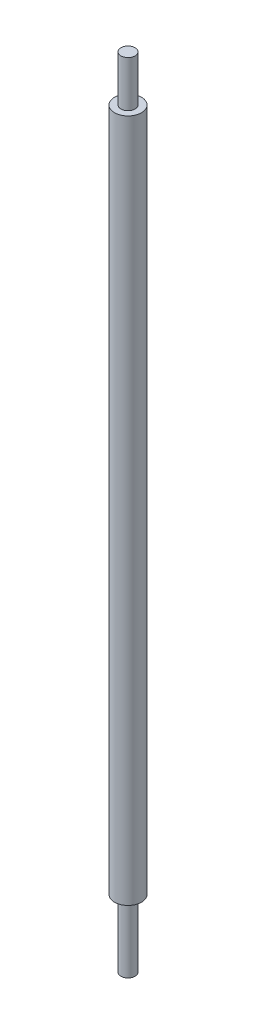
ISO-10303-21;
HEADER;
FILE_DESCRIPTION(('STEP AP214'),'2;1');
FILE_NAME('part.step','',(''),(''),'','','');
FILE_SCHEMA(('AUTOMOTIVE_DESIGN { 1 0 10303 214 1 1 1 1 }'));
ENDSEC;
DATA;
#1=APPLICATION_CONTEXT('core data for automotive mechanical design processes');
#2=APPLICATION_PROTOCOL_DEFINITION('international standard','automotive_design',2000,#1);
#3=PRODUCT_CONTEXT('',#1,'mechanical');
#4=PRODUCT('Part','Part','',(#3));
#5=PRODUCT_RELATED_PRODUCT_CATEGORY('part','',(#4));
#6=PRODUCT_DEFINITION_FORMATION('','',#4);
#7=PRODUCT_DEFINITION_CONTEXT('part definition',#1,'design');
#8=PRODUCT_DEFINITION('design','',#6,#7);
#9=PRODUCT_DEFINITION_SHAPE('','',#8);
#10=(LENGTH_UNIT() NAMED_UNIT(*) SI_UNIT(.MILLI.,.METRE.));
#11=(NAMED_UNIT(*) PLANE_ANGLE_UNIT() SI_UNIT($,.RADIAN.));
#12=(NAMED_UNIT(*) SI_UNIT($,.STERADIAN.) SOLID_ANGLE_UNIT());
#13=UNCERTAINTY_MEASURE_WITH_UNIT(LENGTH_MEASURE(1.E-05),#10,'distance_accuracy_value','');
#14=(GEOMETRIC_REPRESENTATION_CONTEXT(3) GLOBAL_UNCERTAINTY_ASSIGNED_CONTEXT((#13)) GLOBAL_UNIT_ASSIGNED_CONTEXT((#10,
#11,#12)) REPRESENTATION_CONTEXT('',''));
#15=CARTESIAN_POINT('',(0.,0.,0.));
#16=DIRECTION('',(0.,0.,1.));
#17=DIRECTION('',(1.,0.,0.));
#18=AXIS2_PLACEMENT_3D('',#15,#16,#17);
#19=CARTESIAN_POINT('',(0.,450.,0.));
#20=DIRECTION('',(0.,-1.,0.));
#21=DIRECTION('',(0.,0.,-1.));
#22=AXIS2_PLACEMENT_3D('',#19,#20,#21);
#23=CYLINDRICAL_SURFACE('',#22,7.6);
#24=CARTESIAN_POINT('',(0.,424.,0.));
#25=DIRECTION('',(0.,1.,0.));
#26=DIRECTION('',(0.,0.,1.));
#27=AXIS2_PLACEMENT_3D('',#24,#25,#26);
#28=CIRCLE('',#27,7.6);
#29=CARTESIAN_POINT('',(0.,424.,7.6));
#30=VERTEX_POINT('',#29);
#31=EDGE_CURVE('E10',#30,#30,#28,.T.);
#32=ORIENTED_EDGE('',*,*,#31,.F.);
#33=EDGE_LOOP('',(#32));
#34=FACE_BOUND('',#33,.T.);
#35=CARTESIAN_POINT('',(0.,38.,0.));
#36=DIRECTION('',(0.,-1.,0.));
#37=DIRECTION('',(0.,0.,-1.));
#38=AXIS2_PLACEMENT_3D('',#35,#36,#37);
#39=CIRCLE('',#38,7.6);
#40=CARTESIAN_POINT('',(0.,38.,-7.6));
#41=VERTEX_POINT('',#40);
#42=EDGE_CURVE('E49',#41,#41,#39,.T.);
#43=ORIENTED_EDGE('',*,*,#42,.F.);
#44=EDGE_LOOP('',(#43));
#45=FACE_BOUND('',#44,.T.);
#46=ADVANCED_FACE('F34',(#34,#45),#23,.T.);
#47=CARTESIAN_POINT('',(0.,424.,0.));
#48=DIRECTION('',(0.,1.,0.));
#49=DIRECTION('',(0.,0.,1.));
#50=AXIS2_PLACEMENT_3D('',#47,#48,#49);
#51=PLANE('',#50);
#52=CARTESIAN_POINT('',(0.,424.,0.));
#53=DIRECTION('',(0.,1.,0.));
#54=DIRECTION('',(0.,0.,1.));
#55=AXIS2_PLACEMENT_3D('',#52,#53,#54);
#56=CIRCLE('',#55,4.);
#57=CARTESIAN_POINT('',(0.,424.,4.));
#58=VERTEX_POINT('',#57);
#59=EDGE_CURVE('E40',#58,#58,#56,.T.);
#60=ORIENTED_EDGE('',*,*,#59,.F.);
#61=EDGE_LOOP('',(#60));
#62=FACE_BOUND('',#61,.T.);
#63=ORIENTED_EDGE('',*,*,#31,.T.);
#64=EDGE_LOOP('',(#63));
#65=FACE_BOUND('',#64,.T.);
#66=ADVANCED_FACE('F71',(#62,#65),#51,.T.);
#67=CARTESIAN_POINT('',(0.,424.,0.));
#68=DIRECTION('',(0.,1.,0.));
#69=DIRECTION('',(0.,0.,1.));
#70=AXIS2_PLACEMENT_3D('',#67,#68,#69);
#71=CYLINDRICAL_SURFACE('',#70,4.);
#72=ORIENTED_EDGE('',*,*,#59,.T.);
#73=EDGE_LOOP('',(#72));
#74=FACE_BOUND('',#73,.T.);
#75=CARTESIAN_POINT('',(0.,450.,0.));
#76=DIRECTION('',(0.,1.,0.));
#77=DIRECTION('',(0.,0.,1.));
#78=AXIS2_PLACEMENT_3D('',#75,#76,#77);
#79=CIRCLE('',#78,4.);
#80=CARTESIAN_POINT('',(0.,450.,4.));
#81=VERTEX_POINT('',#80);
#82=EDGE_CURVE('E44',#81,#81,#79,.T.);
#83=ORIENTED_EDGE('',*,*,#82,.F.);
#84=EDGE_LOOP('',(#83));
#85=FACE_BOUND('',#84,.T.);
#86=ADVANCED_FACE('F76',(#74,#85),#71,.T.);
#87=CARTESIAN_POINT('',(0.,450.,0.));
#88=DIRECTION('',(0.,1.,0.));
#89=DIRECTION('',(0.,0.,1.));
#90=AXIS2_PLACEMENT_3D('',#87,#88,#89);
#91=PLANE('',#90);
#92=ORIENTED_EDGE('',*,*,#82,.T.);
#93=EDGE_LOOP('',(#92));
#94=FACE_BOUND('',#93,.T.);
#95=ADVANCED_FACE('F66',(#94),#91,.T.);
#96=CARTESIAN_POINT('',(0.,38.,0.));
#97=DIRECTION('',(0.,-1.,0.));
#98=DIRECTION('',(0.,0.,-1.));
#99=AXIS2_PLACEMENT_3D('',#96,#97,#98);
#100=PLANE('',#99);
#101=CARTESIAN_POINT('',(0.,38.,0.));
#102=DIRECTION('',(0.,-1.,0.));
#103=DIRECTION('',(0.,0.,-1.));
#104=AXIS2_PLACEMENT_3D('',#101,#102,#103);
#105=CIRCLE('',#104,4.);
#106=CARTESIAN_POINT('',(0.,38.,-4.));
#107=VERTEX_POINT('',#106);
#108=EDGE_CURVE('E53',#107,#107,#105,.T.);
#109=ORIENTED_EDGE('',*,*,#108,.F.);
#110=EDGE_LOOP('',(#109));
#111=FACE_BOUND('',#110,.T.);
#112=ORIENTED_EDGE('',*,*,#42,.T.);
#113=EDGE_LOOP('',(#112));
#114=FACE_BOUND('',#113,.T.);
#115=ADVANCED_FACE('F63',(#111,#114),#100,.T.);
#116=CARTESIAN_POINT('',(0.,38.,0.));
#117=DIRECTION('',(0.,-1.,0.));
#118=DIRECTION('',(0.,0.,-1.));
#119=AXIS2_PLACEMENT_3D('',#116,#117,#118);
#120=CYLINDRICAL_SURFACE('',#119,4.);
#121=ORIENTED_EDGE('',*,*,#108,.T.);
#122=EDGE_LOOP('',(#121));
#123=FACE_BOUND('',#122,.T.);
#124=CARTESIAN_POINT('',(0.,0.,0.));
#125=DIRECTION('',(0.,-1.,0.));
#126=DIRECTION('',(0.,0.,-1.));
#127=AXIS2_PLACEMENT_3D('',#124,#125,#126);
#128=CIRCLE('',#127,4.);
#129=CARTESIAN_POINT('',(0.,0.,-4.));
#130=VERTEX_POINT('',#129);
#131=EDGE_CURVE('E54',#130,#130,#128,.T.);
#132=ORIENTED_EDGE('',*,*,#131,.F.);
#133=EDGE_LOOP('',(#132));
#134=FACE_BOUND('',#133,.T.);
#135=ADVANCED_FACE('F60',(#123,#134),#120,.T.);
#136=CARTESIAN_POINT('',(0.,0.,0.));
#137=DIRECTION('',(0.,1.,0.));
#138=DIRECTION('',(0.,0.,1.));
#139=AXIS2_PLACEMENT_3D('',#136,#137,#138);
#140=PLANE('',#139);
#141=ORIENTED_EDGE('',*,*,#131,.T.);
#142=EDGE_LOOP('',(#141));
#143=FACE_BOUND('',#142,.T.);
#144=ADVANCED_FACE('F86',(#143),#140,.F.);
#145=CLOSED_SHELL('',(#46,#66,#86,#95,#115,#135,#144));
#146=MANIFOLD_SOLID_BREP('B2',#145);
#147=ADVANCED_BREP_SHAPE_REPRESENTATION('',(#18,#146),#14);
#148=SHAPE_DEFINITION_REPRESENTATION(#9,#147);
ENDSEC;
END-ISO-10303-21;
